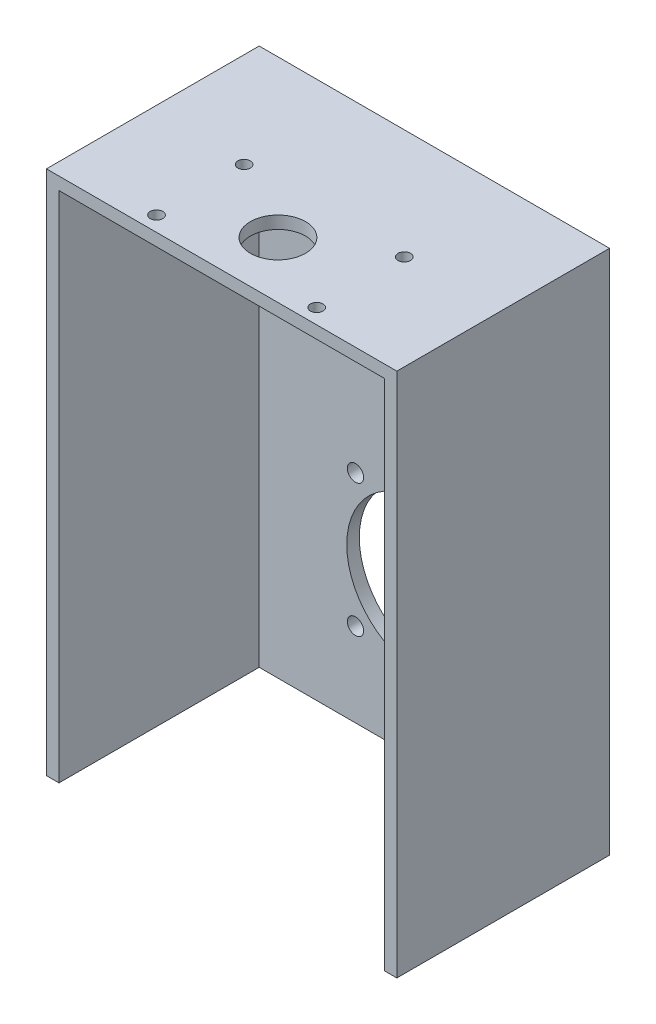
ISO-10303-21;
HEADER;
FILE_DESCRIPTION(('STEP AP214'),'2;1');
FILE_NAME('part.step','',(''),(''),'','','');
FILE_SCHEMA(('AUTOMOTIVE_DESIGN { 1 0 10303 214 1 1 1 1 }'));
ENDSEC;
DATA;
#1=APPLICATION_CONTEXT('core data for automotive mechanical design processes');
#2=APPLICATION_PROTOCOL_DEFINITION('international standard','automotive_design',2000,#1);
#3=PRODUCT_CONTEXT('',#1,'mechanical');
#4=PRODUCT('Part','Part','',(#3));
#5=PRODUCT_RELATED_PRODUCT_CATEGORY('part','',(#4));
#6=PRODUCT_DEFINITION_FORMATION('','',#4);
#7=PRODUCT_DEFINITION_CONTEXT('part definition',#1,'design');
#8=PRODUCT_DEFINITION('design','',#6,#7);
#9=PRODUCT_DEFINITION_SHAPE('','',#8);
#10=(LENGTH_UNIT() NAMED_UNIT(*) SI_UNIT(.MILLI.,.METRE.));
#11=(NAMED_UNIT(*) PLANE_ANGLE_UNIT() SI_UNIT($,.RADIAN.));
#12=(NAMED_UNIT(*) SI_UNIT($,.STERADIAN.) SOLID_ANGLE_UNIT());
#13=UNCERTAINTY_MEASURE_WITH_UNIT(LENGTH_MEASURE(1.E-05),#10,'distance_accuracy_value','');
#14=(GEOMETRIC_REPRESENTATION_CONTEXT(3) GLOBAL_UNCERTAINTY_ASSIGNED_CONTEXT((#13)) GLOBAL_UNIT_ASSIGNED_CONTEXT((#10,
#11,#12)) REPRESENTATION_CONTEXT('',''));
#15=CARTESIAN_POINT('',(0.,0.,0.));
#16=DIRECTION('',(0.,0.,1.));
#17=DIRECTION('',(1.,0.,0.));
#18=AXIS2_PLACEMENT_3D('',#15,#16,#17);
#19=CARTESIAN_POINT('',(-70.,-210.,22.5));
#20=DIRECTION('',(0.,0.,-1.));
#21=DIRECTION('',(-1.,0.,0.));
#22=AXIS2_PLACEMENT_3D('',#19,#20,#21);
#23=PLANE('',#22);
#24=DIRECTION('',(0.,1.,0.));
#25=VECTOR('',#24,1.);
#26=CARTESIAN_POINT('',(65.,-210.,22.5));
#27=LINE('',#26,#25);
#28=CARTESIAN_POINT('',(65.,-210.,22.5));
#29=VERTEX_POINT('',#28);
#30=CARTESIAN_POINT('',(65.,-5.,22.5));
#31=VERTEX_POINT('',#30);
#32=EDGE_CURVE('E124',#29,#31,#27,.T.);
#33=ORIENTED_EDGE('',*,*,#32,.F.);
#34=DIRECTION('',(-1.,0.,0.));
#35=VECTOR('',#34,1.);
#36=CARTESIAN_POINT('',(-70.,-210.,22.5));
#37=LINE('',#36,#35);
#38=CARTESIAN_POINT('',(70.,-210.,22.5));
#39=VERTEX_POINT('',#38);
#40=EDGE_CURVE('E87',#39,#29,#37,.T.);
#41=ORIENTED_EDGE('',*,*,#40,.F.);
#42=DIRECTION('',(0.,1.,0.));
#43=VECTOR('',#42,1.);
#44=CARTESIAN_POINT('',(70.,-210.,22.5));
#45=LINE('',#44,#43);
#46=CARTESIAN_POINT('',(70.,0.,22.5));
#47=VERTEX_POINT('',#46);
#48=EDGE_CURVE('E11',#39,#47,#45,.T.);
#49=ORIENTED_EDGE('',*,*,#48,.T.);
#50=DIRECTION('',(-1.,0.,0.));
#51=VECTOR('',#50,1.);
#52=CARTESIAN_POINT('',(-70.,0.,22.5));
#53=LINE('',#52,#51);
#54=CARTESIAN_POINT('',(-70.,0.,22.5));
#55=VERTEX_POINT('',#54);
#56=EDGE_CURVE('E148',#47,#55,#53,.T.);
#57=ORIENTED_EDGE('',*,*,#56,.T.);
#58=DIRECTION('',(0.,1.,0.));
#59=VECTOR('',#58,1.);
#60=CARTESIAN_POINT('',(-70.,-210.,22.5));
#61=LINE('',#60,#59);
#62=CARTESIAN_POINT('',(-70.,-210.,22.5));
#63=VERTEX_POINT('',#62);
#64=EDGE_CURVE('E47',#63,#55,#61,.T.);
#65=ORIENTED_EDGE('',*,*,#64,.F.);
#66=CARTESIAN_POINT('',(-65.,-210.,22.5));
#67=VERTEX_POINT('',#66);
#68=EDGE_CURVE('E129',#67,#63,#37,.T.);
#69=ORIENTED_EDGE('',*,*,#68,.F.);
#70=DIRECTION('',(0.,1.,0.));
#71=VECTOR('',#70,1.);
#72=CARTESIAN_POINT('',(-65.,-210.,22.5));
#73=LINE('',#72,#71);
#74=CARTESIAN_POINT('',(-65.,-5.,22.5));
#75=VERTEX_POINT('',#74);
#76=EDGE_CURVE('E115',#67,#75,#73,.T.);
#77=ORIENTED_EDGE('',*,*,#76,.T.);
#78=DIRECTION('',(-1.,0.,0.));
#79=VECTOR('',#78,1.);
#80=CARTESIAN_POINT('',(-70.,-5.,22.5));
#81=LINE('',#80,#79);
#82=EDGE_CURVE('E186',#31,#75,#81,.T.);
#83=ORIENTED_EDGE('',*,*,#82,.F.);
#84=EDGE_LOOP('',(#33,#41,#49,#57,#65,#69,#77,#83));
#85=FACE_BOUND('',#84,.T.);
#86=ADVANCED_FACE('F37',(#85),#23,.F.);
#87=CARTESIAN_POINT('',(70.,-210.,22.5));
#88=DIRECTION('',(-1.,0.,0.));
#89=DIRECTION('',(0.,0.,1.));
#90=AXIS2_PLACEMENT_3D('',#87,#88,#89);
#91=PLANE('',#90);
#92=DIRECTION('',(0.,0.,1.));
#93=VECTOR('',#92,1.);
#94=CARTESIAN_POINT('',(70.,0.,22.5));
#95=LINE('',#94,#93);
#96=CARTESIAN_POINT('',(70.,0.,-62.5));
#97=VERTEX_POINT('',#96);
#98=EDGE_CURVE('E145',#97,#47,#95,.T.);
#99=ORIENTED_EDGE('',*,*,#98,.T.);
#100=ORIENTED_EDGE('',*,*,#48,.F.);
#101=DIRECTION('',(0.,0.,1.));
#102=VECTOR('',#101,1.);
#103=CARTESIAN_POINT('',(70.,-210.,22.5));
#104=LINE('',#103,#102);
#105=CARTESIAN_POINT('',(70.,-210.,-62.5));
#106=VERTEX_POINT('',#105);
#107=EDGE_CURVE('E137',#106,#39,#104,.T.);
#108=ORIENTED_EDGE('',*,*,#107,.F.);
#109=DIRECTION('',(0.,1.,0.));
#110=VECTOR('',#109,1.);
#111=CARTESIAN_POINT('',(70.,-210.,-62.5));
#112=LINE('',#111,#110);
#113=EDGE_CURVE('E144',#106,#97,#112,.T.);
#114=ORIENTED_EDGE('',*,*,#113,.T.);
#115=EDGE_LOOP('',(#99,#100,#108,#114));
#116=FACE_BOUND('',#115,.T.);
#117=ADVANCED_FACE('F39',(#116),#91,.F.);
#118=CARTESIAN_POINT('',(-70.,-210.,22.5));
#119=DIRECTION('',(1.,0.,0.));
#120=DIRECTION('',(0.,0.,-1.));
#121=AXIS2_PLACEMENT_3D('',#118,#119,#120);
#122=PLANE('',#121);
#123=DIRECTION('',(0.,0.,-1.));
#124=VECTOR('',#123,1.);
#125=CARTESIAN_POINT('',(-70.,0.,22.5));
#126=LINE('',#125,#124);
#127=CARTESIAN_POINT('',(-70.,0.,-62.5));
#128=VERTEX_POINT('',#127);
#129=EDGE_CURVE('E74',#55,#128,#126,.T.);
#130=ORIENTED_EDGE('',*,*,#129,.T.);
#131=DIRECTION('',(0.,1.,0.));
#132=VECTOR('',#131,1.);
#133=CARTESIAN_POINT('',(-70.,-210.,-62.5));
#134=LINE('',#133,#132);
#135=CARTESIAN_POINT('',(-70.,-210.,-62.5));
#136=VERTEX_POINT('',#135);
#137=EDGE_CURVE('E153',#136,#128,#134,.T.);
#138=ORIENTED_EDGE('',*,*,#137,.F.);
#139=DIRECTION('',(0.,0.,-1.));
#140=VECTOR('',#139,1.);
#141=CARTESIAN_POINT('',(-70.,-210.,22.5));
#142=LINE('',#141,#140);
#143=EDGE_CURVE('E139',#63,#136,#142,.T.);
#144=ORIENTED_EDGE('',*,*,#143,.F.);
#145=ORIENTED_EDGE('',*,*,#64,.T.);
#146=EDGE_LOOP('',(#130,#138,#144,#145));
#147=FACE_BOUND('',#146,.T.);
#148=ADVANCED_FACE('F205',(#147),#122,.F.);
#149=CARTESIAN_POINT('',(-70.,-210.,-62.5));
#150=DIRECTION('',(0.,0.,1.));
#151=DIRECTION('',(1.,0.,0.));
#152=AXIS2_PLACEMENT_3D('',#149,#150,#151);
#153=PLANE('',#152);
#154=CARTESIAN_POINT('',(-26.5165042944956,-123.483495705505,-62.5));
#155=DIRECTION('',(0.,0.,-1.));
#156=DIRECTION('',(-1.,0.,0.));
#157=AXIS2_PLACEMENT_3D('',#154,#155,#156);
#158=CIRCLE('',#157,3.24999999999998);
#159=CARTESIAN_POINT('',(-29.7665042944956,-123.483495705505,-62.5));
#160=VERTEX_POINT('',#159);
#161=EDGE_CURVE('E163',#160,#160,#158,.T.);
#162=ORIENTED_EDGE('',*,*,#161,.F.);
#163=EDGE_LOOP('',(#162));
#164=FACE_BOUND('',#163,.T.);
#165=CARTESIAN_POINT('',(-26.5165042944969,-176.516504294496,-62.5));
#166=DIRECTION('',(0.,0.,-1.));
#167=DIRECTION('',(-1.,0.,0.));
#168=AXIS2_PLACEMENT_3D('',#165,#166,#167);
#169=CIRCLE('',#168,3.25000000000001);
#170=CARTESIAN_POINT('',(-29.7665042944969,-176.516504294496,-62.5));
#171=VERTEX_POINT('',#170);
#172=EDGE_CURVE('E236',#171,#171,#169,.T.);
#173=ORIENTED_EDGE('',*,*,#172,.F.);
#174=EDGE_LOOP('',(#173));
#175=FACE_BOUND('',#174,.T.);
#176=CARTESIAN_POINT('',(26.5165042944943,-176.516504294497,-62.5));
#177=DIRECTION('',(0.,0.,-1.));
#178=DIRECTION('',(-1.,0.,0.));
#179=AXIS2_PLACEMENT_3D('',#176,#177,#178);
#180=CIRCLE('',#179,3.25);
#181=CARTESIAN_POINT('',(23.2665042944943,-176.516504294497,-62.5));
#182=VERTEX_POINT('',#181);
#183=EDGE_CURVE('E240',#182,#182,#180,.T.);
#184=ORIENTED_EDGE('',*,*,#183,.F.);
#185=EDGE_LOOP('',(#184));
#186=FACE_BOUND('',#185,.T.);
#187=CARTESIAN_POINT('',(26.5165042944952,-123.483495705506,-62.5));
#188=DIRECTION('',(0.,0.,-1.));
#189=DIRECTION('',(-1.,0.,0.));
#190=AXIS2_PLACEMENT_3D('',#187,#188,#189);
#191=CIRCLE('',#190,3.25);
#192=CARTESIAN_POINT('',(23.2665042944952,-123.483495705506,-62.5));
#193=VERTEX_POINT('',#192);
#194=EDGE_CURVE('E178',#193,#193,#191,.T.);
#195=ORIENTED_EDGE('',*,*,#194,.F.);
#196=EDGE_LOOP('',(#195));
#197=FACE_BOUND('',#196,.T.);
#198=CARTESIAN_POINT('',(0.,-150.,-62.5));
#199=DIRECTION('',(0.,0.,-1.));
#200=DIRECTION('',(-1.,0.,0.));
#201=AXIS2_PLACEMENT_3D('',#198,#199,#200);
#202=CIRCLE('',#201,30.);
#203=CARTESIAN_POINT('',(-30.,-150.,-62.5));
#204=VERTEX_POINT('',#203);
#205=EDGE_CURVE('E158',#204,#204,#202,.T.);
#206=ORIENTED_EDGE('',*,*,#205,.F.);
#207=EDGE_LOOP('',(#206));
#208=FACE_BOUND('',#207,.T.);
#209=DIRECTION('',(1.,0.,0.));
#210=VECTOR('',#209,1.);
#211=CARTESIAN_POINT('',(-70.,0.,-62.5));
#212=LINE('',#211,#210);
#213=EDGE_CURVE('E80',#128,#97,#212,.T.);
#214=ORIENTED_EDGE('',*,*,#213,.T.);
#215=ORIENTED_EDGE('',*,*,#113,.F.);
#216=DIRECTION('',(1.,0.,0.));
#217=VECTOR('',#216,1.);
#218=CARTESIAN_POINT('',(-70.,-210.,-62.5));
#219=LINE('',#218,#217);
#220=EDGE_CURVE('E56',#136,#106,#219,.T.);
#221=ORIENTED_EDGE('',*,*,#220,.F.);
#222=ORIENTED_EDGE('',*,*,#137,.T.);
#223=EDGE_LOOP('',(#214,#215,#221,#222));
#224=FACE_BOUND('',#223,.T.);
#225=ADVANCED_FACE('F215',(#164,#175,#186,#197,#208,#224),#153,.F.);
#226=CARTESIAN_POINT('',(0.,-210.,0.));
#227=DIRECTION('',(0.,-1.,0.));
#228=DIRECTION('',(0.,0.,-1.));
#229=AXIS2_PLACEMENT_3D('',#226,#227,#228);
#230=PLANE('',#229);
#231=DIRECTION('',(0.,0.,1.));
#232=VECTOR('',#231,1.);
#233=CARTESIAN_POINT('',(65.,-210.,-187.596118312577));
#234=LINE('',#233,#232);
#235=CARTESIAN_POINT('',(65.,-210.,-57.5));
#236=VERTEX_POINT('',#235);
#237=EDGE_CURVE('E133',#236,#29,#234,.T.);
#238=ORIENTED_EDGE('',*,*,#237,.F.);
#239=DIRECTION('',(-1.,0.,0.));
#240=VECTOR('',#239,1.);
#241=CARTESIAN_POINT('',(65.,-210.,-57.5));
#242=LINE('',#241,#240);
#243=CARTESIAN_POINT('',(-65.,-210.,-57.5));
#244=VERTEX_POINT('',#243);
#245=EDGE_CURVE('E132',#236,#244,#242,.T.);
#246=ORIENTED_EDGE('',*,*,#245,.T.);
#247=DIRECTION('',(0.,0.,1.));
#248=VECTOR('',#247,1.);
#249=CARTESIAN_POINT('',(-65.,-210.,-187.596118312577));
#250=LINE('',#249,#248);
#251=EDGE_CURVE('E119',#244,#67,#250,.T.);
#252=ORIENTED_EDGE('',*,*,#251,.T.);
#253=ORIENTED_EDGE('',*,*,#68,.T.);
#254=ORIENTED_EDGE('',*,*,#143,.T.);
#255=ORIENTED_EDGE('',*,*,#220,.T.);
#256=ORIENTED_EDGE('',*,*,#107,.T.);
#257=ORIENTED_EDGE('',*,*,#40,.T.);
#258=EDGE_LOOP('',(#238,#246,#252,#253,#254,#255,#256,#257));
#259=FACE_BOUND('',#258,.T.);
#260=ADVANCED_FACE('F128',(#259),#230,.T.);
#261=CARTESIAN_POINT('',(0.,0.,0.));
#262=DIRECTION('',(0.,-1.,0.));
#263=DIRECTION('',(0.,0.,-1.));
#264=AXIS2_PLACEMENT_3D('',#261,#262,#263);
#265=PLANE('',#264);
#266=CARTESIAN_POINT('',(-32.0208659224776,0.,-18.5));
#267=DIRECTION('',(0.,1.,0.));
#268=DIRECTION('',(0.,0.,1.));
#269=AXIS2_PLACEMENT_3D('',#266,#267,#268);
#270=CIRCLE('',#269,2.49999999999999);
#271=CARTESIAN_POINT('',(-32.0208659224776,0.,-16.));
#272=VERTEX_POINT('',#271);
#273=EDGE_CURVE('E332',#272,#272,#270,.T.);
#274=ORIENTED_EDGE('',*,*,#273,.F.);
#275=EDGE_LOOP('',(#274));
#276=FACE_BOUND('',#275,.T.);
#277=CARTESIAN_POINT('',(31.9791340775224,0.,16.5));
#278=DIRECTION('',(0.,1.,0.));
#279=DIRECTION('',(0.,0.,1.));
#280=AXIS2_PLACEMENT_3D('',#277,#278,#279);
#281=CIRCLE('',#280,2.5);
#282=CARTESIAN_POINT('',(31.9791340775224,0.,19.));
#283=VERTEX_POINT('',#282);
#284=EDGE_CURVE('E336',#283,#283,#281,.T.);
#285=ORIENTED_EDGE('',*,*,#284,.F.);
#286=EDGE_LOOP('',(#285));
#287=FACE_BOUND('',#286,.T.);
#288=CARTESIAN_POINT('',(31.9791340775224,0.,-18.5));
#289=DIRECTION('',(0.,1.,0.));
#290=DIRECTION('',(0.,0.,1.));
#291=AXIS2_PLACEMENT_3D('',#288,#289,#290);
#292=CIRCLE('',#291,2.5);
#293=CARTESIAN_POINT('',(31.9791340775224,0.,-16.));
#294=VERTEX_POINT('',#293);
#295=EDGE_CURVE('E342',#294,#294,#292,.T.);
#296=ORIENTED_EDGE('',*,*,#295,.F.);
#297=EDGE_LOOP('',(#296));
#298=FACE_BOUND('',#297,.T.);
#299=CARTESIAN_POINT('',(-32.0208659224776,0.,16.5));
#300=DIRECTION('',(0.,1.,0.));
#301=DIRECTION('',(0.,0.,1.));
#302=AXIS2_PLACEMENT_3D('',#299,#300,#301);
#303=CIRCLE('',#302,2.49999999999999);
#304=CARTESIAN_POINT('',(-32.0208659224776,0.,19.));
#305=VERTEX_POINT('',#304);
#306=EDGE_CURVE('E334',#305,#305,#303,.T.);
#307=ORIENTED_EDGE('',*,*,#306,.F.);
#308=EDGE_LOOP('',(#307));
#309=FACE_BOUND('',#308,.T.);
#310=CARTESIAN_POINT('',(0.,0.,0.));
#311=DIRECTION('',(0.,-1.,0.));
#312=DIRECTION('',(0.,0.,-1.));
#313=AXIS2_PLACEMENT_3D('',#310,#311,#312);
#314=CIRCLE('',#313,11.);
#315=CARTESIAN_POINT('',(0.,0.,-11.));
#316=VERTEX_POINT('',#315);
#317=EDGE_CURVE('E245',#316,#316,#314,.T.);
#318=ORIENTED_EDGE('',*,*,#317,.T.);
#319=EDGE_LOOP('',(#318));
#320=FACE_BOUND('',#319,.T.);
#321=ORIENTED_EDGE('',*,*,#98,.F.);
#322=ORIENTED_EDGE('',*,*,#213,.F.);
#323=ORIENTED_EDGE('',*,*,#129,.F.);
#324=ORIENTED_EDGE('',*,*,#56,.F.);
#325=EDGE_LOOP('',(#321,#322,#323,#324));
#326=FACE_BOUND('',#325,.T.);
#327=ADVANCED_FACE('F206',(#276,#287,#298,#309,#320,#326),#265,.F.);
#328=CARTESIAN_POINT('',(65.,-210.,22.5));
#329=DIRECTION('',(-1.,0.,0.));
#330=DIRECTION('',(0.,0.,1.));
#331=AXIS2_PLACEMENT_3D('',#328,#329,#330);
#332=PLANE('',#331);
#333=DIRECTION('',(0.,0.,1.));
#334=VECTOR('',#333,1.);
#335=CARTESIAN_POINT('',(65.,-5.,22.5));
#336=LINE('',#335,#334);
#337=CARTESIAN_POINT('',(65.,-5.,-57.5));
#338=VERTEX_POINT('',#337);
#339=EDGE_CURVE('E181',#338,#31,#336,.T.);
#340=ORIENTED_EDGE('',*,*,#339,.F.);
#341=DIRECTION('',(0.,1.,0.));
#342=VECTOR('',#341,1.);
#343=CARTESIAN_POINT('',(65.,-210.,-57.5));
#344=LINE('',#343,#342);
#345=EDGE_CURVE('E187',#236,#338,#344,.T.);
#346=ORIENTED_EDGE('',*,*,#345,.F.);
#347=ORIENTED_EDGE('',*,*,#237,.T.);
#348=ORIENTED_EDGE('',*,*,#32,.T.);
#349=EDGE_LOOP('',(#340,#346,#347,#348));
#350=FACE_BOUND('',#349,.T.);
#351=ADVANCED_FACE('F199',(#350),#332,.T.);
#352=CARTESIAN_POINT('',(-65.,-210.,22.5));
#353=DIRECTION('',(1.,0.,0.));
#354=DIRECTION('',(0.,0.,-1.));
#355=AXIS2_PLACEMENT_3D('',#352,#353,#354);
#356=PLANE('',#355);
#357=DIRECTION('',(0.,0.,-1.));
#358=VECTOR('',#357,1.);
#359=CARTESIAN_POINT('',(-65.,-5.,22.5));
#360=LINE('',#359,#358);
#361=CARTESIAN_POINT('',(-65.,-5.,-57.5));
#362=VERTEX_POINT('',#361);
#363=EDGE_CURVE('E121',#75,#362,#360,.T.);
#364=ORIENTED_EDGE('',*,*,#363,.F.);
#365=ORIENTED_EDGE('',*,*,#76,.F.);
#366=ORIENTED_EDGE('',*,*,#251,.F.);
#367=DIRECTION('',(0.,1.,0.));
#368=VECTOR('',#367,1.);
#369=CARTESIAN_POINT('',(-65.,-210.,-57.5));
#370=LINE('',#369,#368);
#371=EDGE_CURVE('E125',#244,#362,#370,.T.);
#372=ORIENTED_EDGE('',*,*,#371,.T.);
#373=EDGE_LOOP('',(#364,#365,#366,#372));
#374=FACE_BOUND('',#373,.T.);
#375=ADVANCED_FACE('F117',(#374),#356,.T.);
#376=CARTESIAN_POINT('',(-70.,-210.,-57.5));
#377=DIRECTION('',(0.,0.,1.));
#378=DIRECTION('',(1.,0.,0.));
#379=AXIS2_PLACEMENT_3D('',#376,#377,#378);
#380=PLANE('',#379);
#381=CARTESIAN_POINT('',(-26.5165042944956,-123.483495705505,-57.5));
#382=DIRECTION('',(0.,0.,1.));
#383=DIRECTION('',(1.,0.,0.));
#384=AXIS2_PLACEMENT_3D('',#381,#382,#383);
#385=CIRCLE('',#384,3.24999999999998);
#386=CARTESIAN_POINT('',(-23.2665042944956,-123.483495705505,-57.5));
#387=VERTEX_POINT('',#386);
#388=EDGE_CURVE('E41',#387,#387,#385,.T.);
#389=ORIENTED_EDGE('',*,*,#388,.F.);
#390=EDGE_LOOP('',(#389));
#391=FACE_BOUND('',#390,.T.);
#392=CARTESIAN_POINT('',(-26.5165042944969,-176.516504294496,-57.5));
#393=DIRECTION('',(0.,0.,1.));
#394=DIRECTION('',(1.,0.,0.));
#395=AXIS2_PLACEMENT_3D('',#392,#393,#394);
#396=CIRCLE('',#395,3.25000000000001);
#397=CARTESIAN_POINT('',(-23.2665042944969,-176.516504294496,-57.5));
#398=VERTEX_POINT('',#397);
#399=EDGE_CURVE('E165',#398,#398,#396,.T.);
#400=ORIENTED_EDGE('',*,*,#399,.F.);
#401=EDGE_LOOP('',(#400));
#402=FACE_BOUND('',#401,.T.);
#403=CARTESIAN_POINT('',(26.5165042944943,-176.516504294497,-57.5));
#404=DIRECTION('',(0.,0.,1.));
#405=DIRECTION('',(1.,0.,0.));
#406=AXIS2_PLACEMENT_3D('',#403,#404,#405);
#407=CIRCLE('',#406,3.25);
#408=CARTESIAN_POINT('',(29.7665042944943,-176.516504294497,-57.5));
#409=VERTEX_POINT('',#408);
#410=EDGE_CURVE('E162',#409,#409,#407,.T.);
#411=ORIENTED_EDGE('',*,*,#410,.F.);
#412=EDGE_LOOP('',(#411));
#413=FACE_BOUND('',#412,.T.);
#414=CARTESIAN_POINT('',(26.5165042944952,-123.483495705506,-57.5));
#415=DIRECTION('',(0.,0.,1.));
#416=DIRECTION('',(1.,0.,0.));
#417=AXIS2_PLACEMENT_3D('',#414,#415,#416);
#418=CIRCLE('',#417,3.25);
#419=CARTESIAN_POINT('',(29.7665042944952,-123.483495705506,-57.5));
#420=VERTEX_POINT('',#419);
#421=EDGE_CURVE('E159',#420,#420,#418,.T.);
#422=ORIENTED_EDGE('',*,*,#421,.F.);
#423=EDGE_LOOP('',(#422));
#424=FACE_BOUND('',#423,.T.);
#425=CARTESIAN_POINT('',(0.,-150.,-57.5));
#426=DIRECTION('',(0.,0.,1.));
#427=DIRECTION('',(1.,0.,0.));
#428=AXIS2_PLACEMENT_3D('',#425,#426,#427);
#429=CIRCLE('',#428,30.);
#430=CARTESIAN_POINT('',(30.,-150.,-57.5));
#431=VERTEX_POINT('',#430);
#432=EDGE_CURVE('E134',#431,#431,#429,.T.);
#433=ORIENTED_EDGE('',*,*,#432,.F.);
#434=EDGE_LOOP('',(#433));
#435=FACE_BOUND('',#434,.T.);
#436=DIRECTION('',(1.,0.,0.));
#437=VECTOR('',#436,1.);
#438=CARTESIAN_POINT('',(-70.,-5.,-57.5));
#439=LINE('',#438,#437);
#440=EDGE_CURVE('E190',#362,#338,#439,.T.);
#441=ORIENTED_EDGE('',*,*,#440,.F.);
#442=ORIENTED_EDGE('',*,*,#371,.F.);
#443=ORIENTED_EDGE('',*,*,#245,.F.);
#444=ORIENTED_EDGE('',*,*,#345,.T.);
#445=EDGE_LOOP('',(#441,#442,#443,#444));
#446=FACE_BOUND('',#445,.T.);
#447=ADVANCED_FACE('F283',(#391,#402,#413,#424,#435,#446),#380,.T.);
#448=CARTESIAN_POINT('',(0.,-5.,0.));
#449=DIRECTION('',(0.,-1.,0.));
#450=DIRECTION('',(0.,0.,-1.));
#451=AXIS2_PLACEMENT_3D('',#448,#449,#450);
#452=PLANE('',#451);
#453=CARTESIAN_POINT('',(-32.0208659224776,-5.,-18.5));
#454=DIRECTION('',(0.,1.,0.));
#455=DIRECTION('',(0.,0.,1.));
#456=AXIS2_PLACEMENT_3D('',#453,#454,#455);
#457=CIRCLE('',#456,2.49999999999999);
#458=CARTESIAN_POINT('',(-32.0208659224776,-5.,-16.));
#459=VERTEX_POINT('',#458);
#460=EDGE_CURVE('E294',#459,#459,#457,.T.);
#461=ORIENTED_EDGE('',*,*,#460,.T.);
#462=EDGE_LOOP('',(#461));
#463=FACE_BOUND('',#462,.T.);
#464=CARTESIAN_POINT('',(31.9791340775224,-5.,16.5));
#465=DIRECTION('',(0.,1.,0.));
#466=DIRECTION('',(0.,0.,1.));
#467=AXIS2_PLACEMENT_3D('',#464,#465,#466);
#468=CIRCLE('',#467,2.5);
#469=CARTESIAN_POINT('',(31.9791340775224,-5.,19.));
#470=VERTEX_POINT('',#469);
#471=EDGE_CURVE('E298',#470,#470,#468,.T.);
#472=ORIENTED_EDGE('',*,*,#471,.T.);
#473=EDGE_LOOP('',(#472));
#474=FACE_BOUND('',#473,.T.);
#475=CARTESIAN_POINT('',(31.9791340775224,-5.,-18.5));
#476=DIRECTION('',(0.,1.,0.));
#477=DIRECTION('',(0.,0.,1.));
#478=AXIS2_PLACEMENT_3D('',#475,#476,#477);
#479=CIRCLE('',#478,2.5);
#480=CARTESIAN_POINT('',(31.9791340775224,-5.,-16.));
#481=VERTEX_POINT('',#480);
#482=EDGE_CURVE('E302',#481,#481,#479,.T.);
#483=ORIENTED_EDGE('',*,*,#482,.T.);
#484=EDGE_LOOP('',(#483));
#485=FACE_BOUND('',#484,.T.);
#486=CARTESIAN_POINT('',(-32.0208659224776,-5.,16.5));
#487=DIRECTION('',(0.,1.,0.));
#488=DIRECTION('',(0.,0.,1.));
#489=AXIS2_PLACEMENT_3D('',#486,#487,#488);
#490=CIRCLE('',#489,2.49999999999999);
#491=CARTESIAN_POINT('',(-32.0208659224776,-5.,19.));
#492=VERTEX_POINT('',#491);
#493=EDGE_CURVE('E252',#492,#492,#490,.T.);
#494=ORIENTED_EDGE('',*,*,#493,.T.);
#495=EDGE_LOOP('',(#494));
#496=FACE_BOUND('',#495,.T.);
#497=CARTESIAN_POINT('',(0.,-5.,0.));
#498=DIRECTION('',(0.,-1.,0.));
#499=DIRECTION('',(0.,0.,-1.));
#500=AXIS2_PLACEMENT_3D('',#497,#498,#499);
#501=CIRCLE('',#500,11.);
#502=CARTESIAN_POINT('',(0.,-5.,-11.));
#503=VERTEX_POINT('',#502);
#504=EDGE_CURVE('E247',#503,#503,#501,.F.);
#505=ORIENTED_EDGE('',*,*,#504,.T.);
#506=EDGE_LOOP('',(#505));
#507=FACE_BOUND('',#506,.T.);
#508=ORIENTED_EDGE('',*,*,#339,.T.);
#509=ORIENTED_EDGE('',*,*,#82,.T.);
#510=ORIENTED_EDGE('',*,*,#363,.T.);
#511=ORIENTED_EDGE('',*,*,#440,.T.);
#512=EDGE_LOOP('',(#508,#509,#510,#511));
#513=FACE_BOUND('',#512,.T.);
#514=ADVANCED_FACE('F196',(#463,#474,#485,#496,#507,#513),#452,.T.);
#515=CARTESIAN_POINT('',(0.,-150.,-52.5));
#516=DIRECTION('',(0.,0.,-1.));
#517=DIRECTION('',(-1.,0.,0.));
#518=AXIS2_PLACEMENT_3D('',#515,#516,#517);
#519=CYLINDRICAL_SURFACE('',#518,30.);
#520=ORIENTED_EDGE('',*,*,#432,.T.);
#521=EDGE_LOOP('',(#520));
#522=FACE_BOUND('',#521,.T.);
#523=ORIENTED_EDGE('',*,*,#205,.T.);
#524=EDGE_LOOP('',(#523));
#525=FACE_BOUND('',#524,.T.);
#526=ADVANCED_FACE('F276',(#522,#525),#519,.F.);
#527=CARTESIAN_POINT('',(26.5165042944952,-123.483495705506,-52.5));
#528=DIRECTION('',(0.,0.,-1.));
#529=DIRECTION('',(-1.,0.,0.));
#530=AXIS2_PLACEMENT_3D('',#527,#528,#529);
#531=CYLINDRICAL_SURFACE('',#530,3.25);
#532=ORIENTED_EDGE('',*,*,#421,.T.);
#533=EDGE_LOOP('',(#532));
#534=FACE_BOUND('',#533,.T.);
#535=ORIENTED_EDGE('',*,*,#194,.T.);
#536=EDGE_LOOP('',(#535));
#537=FACE_BOUND('',#536,.T.);
#538=ADVANCED_FACE('F269',(#534,#537),#531,.F.);
#539=CARTESIAN_POINT('',(26.5165042944943,-176.516504294497,-52.5));
#540=DIRECTION('',(0.,0.,-1.));
#541=DIRECTION('',(-1.,0.,0.));
#542=AXIS2_PLACEMENT_3D('',#539,#540,#541);
#543=CYLINDRICAL_SURFACE('',#542,3.25);
#544=ORIENTED_EDGE('',*,*,#410,.T.);
#545=EDGE_LOOP('',(#544));
#546=FACE_BOUND('',#545,.T.);
#547=ORIENTED_EDGE('',*,*,#183,.T.);
#548=EDGE_LOOP('',(#547));
#549=FACE_BOUND('',#548,.T.);
#550=ADVANCED_FACE('F261',(#546,#549),#543,.F.);
#551=CARTESIAN_POINT('',(-26.5165042944969,-176.516504294496,-52.5));
#552=DIRECTION('',(0.,0.,-1.));
#553=DIRECTION('',(-1.,0.,0.));
#554=AXIS2_PLACEMENT_3D('',#551,#552,#553);
#555=CYLINDRICAL_SURFACE('',#554,3.25000000000001);
#556=ORIENTED_EDGE('',*,*,#399,.T.);
#557=EDGE_LOOP('',(#556));
#558=FACE_BOUND('',#557,.T.);
#559=ORIENTED_EDGE('',*,*,#172,.T.);
#560=EDGE_LOOP('',(#559));
#561=FACE_BOUND('',#560,.T.);
#562=ADVANCED_FACE('F258',(#558,#561),#555,.F.);
#563=CARTESIAN_POINT('',(-26.5165042944956,-123.483495705505,-52.5));
#564=DIRECTION('',(0.,0.,-1.));
#565=DIRECTION('',(-1.,0.,0.));
#566=AXIS2_PLACEMENT_3D('',#563,#564,#565);
#567=CYLINDRICAL_SURFACE('',#566,3.24999999999998);
#568=ORIENTED_EDGE('',*,*,#388,.T.);
#569=EDGE_LOOP('',(#568));
#570=FACE_BOUND('',#569,.T.);
#571=ORIENTED_EDGE('',*,*,#161,.T.);
#572=EDGE_LOOP('',(#571));
#573=FACE_BOUND('',#572,.T.);
#574=ADVANCED_FACE('F260',(#570,#573),#567,.F.);
#575=CARTESIAN_POINT('',(0.,-36.1126983722081,0.));
#576=DIRECTION('',(0.,1.,0.));
#577=DIRECTION('',(0.,0.,1.));
#578=AXIS2_PLACEMENT_3D('',#575,#576,#577);
#579=CYLINDRICAL_SURFACE('',#578,11.);
#580=ORIENTED_EDGE('',*,*,#504,.F.);
#581=EDGE_LOOP('',(#580));
#582=FACE_BOUND('',#581,.T.);
#583=ORIENTED_EDGE('',*,*,#317,.F.);
#584=EDGE_LOOP('',(#583));
#585=FACE_BOUND('',#584,.T.);
#586=ADVANCED_FACE('F267',(#582,#585),#579,.F.);
#587=CARTESIAN_POINT('',(-32.0208659224776,-5.,16.5));
#588=DIRECTION('',(0.,1.,0.));
#589=DIRECTION('',(0.,0.,1.));
#590=AXIS2_PLACEMENT_3D('',#587,#588,#589);
#591=CYLINDRICAL_SURFACE('',#590,2.49999999999999);
#592=ORIENTED_EDGE('',*,*,#493,.F.);
#593=EDGE_LOOP('',(#592));
#594=FACE_BOUND('',#593,.T.);
#595=ORIENTED_EDGE('',*,*,#306,.T.);
#596=EDGE_LOOP('',(#595));
#597=FACE_BOUND('',#596,.T.);
#598=ADVANCED_FACE('F310',(#594,#597),#591,.F.);
#599=CARTESIAN_POINT('',(31.9791340775224,-5.,-18.5));
#600=DIRECTION('',(0.,1.,0.));
#601=DIRECTION('',(0.,0.,1.));
#602=AXIS2_PLACEMENT_3D('',#599,#600,#601);
#603=CYLINDRICAL_SURFACE('',#602,2.5);
#604=ORIENTED_EDGE('',*,*,#482,.F.);
#605=EDGE_LOOP('',(#604));
#606=FACE_BOUND('',#605,.T.);
#607=ORIENTED_EDGE('',*,*,#295,.T.);
#608=EDGE_LOOP('',(#607));
#609=FACE_BOUND('',#608,.T.);
#610=ADVANCED_FACE('F314',(#606,#609),#603,.F.);
#611=CARTESIAN_POINT('',(31.9791340775224,-5.,16.5));
#612=DIRECTION('',(0.,1.,0.));
#613=DIRECTION('',(0.,0.,1.));
#614=AXIS2_PLACEMENT_3D('',#611,#612,#613);
#615=CYLINDRICAL_SURFACE('',#614,2.5);
#616=ORIENTED_EDGE('',*,*,#471,.F.);
#617=EDGE_LOOP('',(#616));
#618=FACE_BOUND('',#617,.T.);
#619=ORIENTED_EDGE('',*,*,#284,.T.);
#620=EDGE_LOOP('',(#619));
#621=FACE_BOUND('',#620,.T.);
#622=ADVANCED_FACE('F320',(#618,#621),#615,.F.);
#623=CARTESIAN_POINT('',(-32.0208659224776,-5.,-18.5));
#624=DIRECTION('',(0.,1.,0.));
#625=DIRECTION('',(0.,0.,1.));
#626=AXIS2_PLACEMENT_3D('',#623,#624,#625);
#627=CYLINDRICAL_SURFACE('',#626,2.49999999999999);
#628=ORIENTED_EDGE('',*,*,#460,.F.);
#629=EDGE_LOOP('',(#628));
#630=FACE_BOUND('',#629,.T.);
#631=ORIENTED_EDGE('',*,*,#273,.T.);
#632=EDGE_LOOP('',(#631));
#633=FACE_BOUND('',#632,.T.);
#634=ADVANCED_FACE('F324',(#630,#633),#627,.F.);
#635=CLOSED_SHELL('',(#86,#117,#148,#225,#260,#327,#351,#375,#447,#514,#526,#538,#550,#562,#574,
#586,#598,#610,#622,#634));
#636=MANIFOLD_SOLID_BREP('B2',#635);
#637=ADVANCED_BREP_SHAPE_REPRESENTATION('',(#18,#636),#14);
#638=SHAPE_DEFINITION_REPRESENTATION(#9,#637);
ENDSEC;
END-ISO-10303-21;
